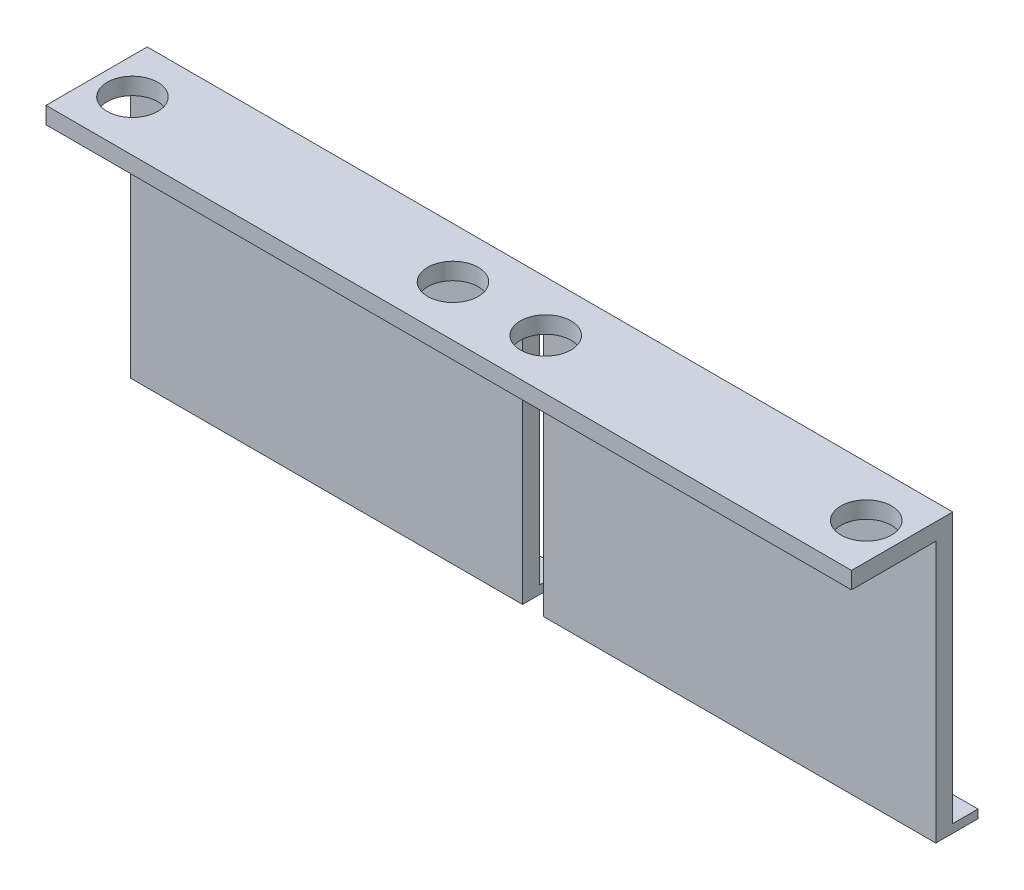
ISO-10303-21;
HEADER;
FILE_DESCRIPTION(('STEP AP214'),'2;1');
FILE_NAME('part.step','',(''),(''),'','','');
FILE_SCHEMA(('AUTOMOTIVE_DESIGN { 1 0 10303 214 1 1 1 1 }'));
ENDSEC;
DATA;
#1=APPLICATION_CONTEXT('core data for automotive mechanical design processes');
#2=APPLICATION_PROTOCOL_DEFINITION('international standard','automotive_design',2000,#1);
#3=PRODUCT_CONTEXT('',#1,'mechanical');
#4=PRODUCT('Part','Part','',(#3));
#5=PRODUCT_RELATED_PRODUCT_CATEGORY('part','',(#4));
#6=PRODUCT_DEFINITION_FORMATION('','',#4);
#7=PRODUCT_DEFINITION_CONTEXT('part definition',#1,'design');
#8=PRODUCT_DEFINITION('design','',#6,#7);
#9=PRODUCT_DEFINITION_SHAPE('','',#8);
#10=(LENGTH_UNIT() NAMED_UNIT(*) SI_UNIT(.MILLI.,.METRE.));
#11=(NAMED_UNIT(*) PLANE_ANGLE_UNIT() SI_UNIT($,.RADIAN.));
#12=(NAMED_UNIT(*) SI_UNIT($,.STERADIAN.) SOLID_ANGLE_UNIT());
#13=UNCERTAINTY_MEASURE_WITH_UNIT(LENGTH_MEASURE(1.E-05),#10,'distance_accuracy_value','');
#14=(GEOMETRIC_REPRESENTATION_CONTEXT(3) GLOBAL_UNCERTAINTY_ASSIGNED_CONTEXT((#13)) GLOBAL_UNIT_ASSIGNED_CONTEXT((#10,
#11,#12)) REPRESENTATION_CONTEXT('',''));
#15=CARTESIAN_POINT('',(0.,0.,0.));
#16=DIRECTION('',(0.,0.,1.));
#17=DIRECTION('',(1.,0.,0.));
#18=AXIS2_PLACEMENT_3D('',#15,#16,#17);
#19=CARTESIAN_POINT('',(0.,0.,0.));
#20=DIRECTION('',(0.,0.,-1.));
#21=DIRECTION('',(-1.,0.,0.));
#22=AXIS2_PLACEMENT_3D('',#19,#20,#21);
#23=PLANE('',#22);
#24=DIRECTION('',(0.,1.,0.));
#25=VECTOR('',#24,1.);
#26=CARTESIAN_POINT('',(-2.99862487690346,-11.2527197158987,0.));
#27=LINE('',#26,#25);
#28=CARTESIAN_POINT('',(-2.99862487690346,-10.2527197158987,0.));
#29=VERTEX_POINT('',#28);
#30=CARTESIAN_POINT('',(-2.99862487690346,17.7472802841013,0.));
#31=VERTEX_POINT('',#30);
#32=EDGE_CURVE('E260',#29,#31,#27,.T.);
#33=ORIENTED_EDGE('',*,*,#32,.F.);
#34=DIRECTION('',(1.,0.,0.));
#35=VECTOR('',#34,1.);
#36=CARTESIAN_POINT('',(-2.99862487690346,-10.2527197158987,0.));
#37=LINE('',#36,#35);
#38=CARTESIAN_POINT('',(-49.4986248769035,-10.2527197158987,0.));
#39=VERTEX_POINT('',#38);
#40=EDGE_CURVE('E162',#39,#29,#37,.T.);
#41=ORIENTED_EDGE('',*,*,#40,.F.);
#42=DIRECTION('',(0.,-1.,0.));
#43=VECTOR('',#42,1.);
#44=CARTESIAN_POINT('',(-49.4986248769035,-11.2527197158987,0.));
#45=LINE('',#44,#43);
#46=CARTESIAN_POINT('',(-49.4986248769035,21.7472802841013,0.));
#47=VERTEX_POINT('',#46);
#48=EDGE_CURVE('E257',#47,#39,#45,.T.);
#49=ORIENTED_EDGE('',*,*,#48,.F.);
#50=DIRECTION('',(-1.,0.,0.));
#51=VECTOR('',#50,1.);
#52=CARTESIAN_POINT('',(-49.4986248769035,21.7472802841013,0.));
#53=LINE('',#52,#51);
#54=CARTESIAN_POINT('',(46.0013751230965,21.7472802841013,0.));
#55=VERTEX_POINT('',#54);
#56=EDGE_CURVE('E215',#55,#47,#53,.T.);
#57=ORIENTED_EDGE('',*,*,#56,.F.);
#58=DIRECTION('',(0.,1.,0.));
#59=VECTOR('',#58,1.);
#60=CARTESIAN_POINT('',(46.0013751230965,-11.2527197158987,0.));
#61=LINE('',#60,#59);
#62=CARTESIAN_POINT('',(46.0013751230965,-10.2527197158987,0.));
#63=VERTEX_POINT('',#62);
#64=EDGE_CURVE('E213',#63,#55,#61,.T.);
#65=ORIENTED_EDGE('',*,*,#64,.F.);
#66=DIRECTION('',(1.,0.,0.));
#67=VECTOR('',#66,1.);
#68=CARTESIAN_POINT('',(46.0013751230965,-10.2527197158987,0.));
#69=LINE('',#68,#67);
#70=CARTESIAN_POINT('',(-0.498624876903456,-10.2527197158987,0.));
#71=VERTEX_POINT('',#70);
#72=EDGE_CURVE('E60',#71,#63,#69,.T.);
#73=ORIENTED_EDGE('',*,*,#72,.F.);
#74=DIRECTION('',(0.,-1.,0.));
#75=VECTOR('',#74,1.);
#76=CARTESIAN_POINT('',(-0.498624876903457,17.7472802841013,0.));
#77=LINE('',#76,#75);
#78=CARTESIAN_POINT('',(-0.498624876903457,17.7472802841013,0.));
#79=VERTEX_POINT('',#78);
#80=EDGE_CURVE('E189',#79,#71,#77,.T.);
#81=ORIENTED_EDGE('',*,*,#80,.F.);
#82=DIRECTION('',(1.,0.,0.));
#83=VECTOR('',#82,1.);
#84=CARTESIAN_POINT('',(-2.99862487690346,17.7472802841013,0.));
#85=LINE('',#84,#83);
#86=EDGE_CURVE('E262',#31,#79,#85,.T.);
#87=ORIENTED_EDGE('',*,*,#86,.F.);
#88=EDGE_LOOP('',(#33,#41,#49,#57,#65,#73,#81,#87));
#89=FACE_BOUND('',#88,.T.);
#90=ADVANCED_FACE('F35',(#89),#23,.T.);
#91=CARTESIAN_POINT('',(0.,0.,2.));
#92=DIRECTION('',(0.,0.,-1.));
#93=DIRECTION('',(-1.,0.,0.));
#94=AXIS2_PLACEMENT_3D('',#91,#92,#93);
#95=PLANE('',#94);
#96=DIRECTION('',(1.,0.,0.));
#97=VECTOR('',#96,1.);
#98=CARTESIAN_POINT('',(-49.4986248769035,19.7472802841013,2.));
#99=LINE('',#98,#97);
#100=CARTESIAN_POINT('',(-49.4986248769035,19.7472802841013,2.));
#101=VERTEX_POINT('',#100);
#102=CARTESIAN_POINT('',(46.0013751230965,19.7472802841013,2.));
#103=VERTEX_POINT('',#102);
#104=EDGE_CURVE('E480',#101,#103,#99,.T.);
#105=ORIENTED_EDGE('',*,*,#104,.F.);
#106=DIRECTION('',(0.,-1.,0.));
#107=VECTOR('',#106,1.);
#108=CARTESIAN_POINT('',(-49.4986248769035,-11.2527197158987,2.));
#109=LINE('',#108,#107);
#110=CARTESIAN_POINT('',(-49.4986248769035,-11.2527197158987,2.));
#111=VERTEX_POINT('',#110);
#112=EDGE_CURVE('E221',#101,#111,#109,.T.);
#113=ORIENTED_EDGE('',*,*,#112,.T.);
#114=DIRECTION('',(1.,0.,0.));
#115=VECTOR('',#114,1.);
#116=CARTESIAN_POINT('',(-49.4986248769035,-11.2527197158987,2.));
#117=LINE('',#116,#115);
#118=CARTESIAN_POINT('',(-2.99862487690346,-11.2527197158987,2.));
#119=VERTEX_POINT('',#118);
#120=EDGE_CURVE('E240',#111,#119,#117,.T.);
#121=ORIENTED_EDGE('',*,*,#120,.T.);
#122=DIRECTION('',(0.,1.,0.));
#123=VECTOR('',#122,1.);
#124=CARTESIAN_POINT('',(-2.99862487690346,-11.2527197158987,2.));
#125=LINE('',#124,#123);
#126=CARTESIAN_POINT('',(-2.99862487690346,17.7472802841013,2.));
#127=VERTEX_POINT('',#126);
#128=EDGE_CURVE('E146',#119,#127,#125,.T.);
#129=ORIENTED_EDGE('',*,*,#128,.T.);
#130=DIRECTION('',(1.,0.,0.));
#131=VECTOR('',#130,1.);
#132=CARTESIAN_POINT('',(-2.99862487690346,17.7472802841013,2.));
#133=LINE('',#132,#131);
#134=CARTESIAN_POINT('',(-0.498624876903457,17.7472802841013,2.));
#135=VERTEX_POINT('',#134);
#136=EDGE_CURVE('E250',#127,#135,#133,.T.);
#137=ORIENTED_EDGE('',*,*,#136,.T.);
#138=DIRECTION('',(0.,-1.,0.));
#139=VECTOR('',#138,1.);
#140=CARTESIAN_POINT('',(-0.498624876903457,17.7472802841013,2.));
#141=LINE('',#140,#139);
#142=CARTESIAN_POINT('',(-0.498624876903456,-11.2527197158987,2.));
#143=VERTEX_POINT('',#142);
#144=EDGE_CURVE('E252',#135,#143,#141,.T.);
#145=ORIENTED_EDGE('',*,*,#144,.T.);
#146=DIRECTION('',(1.,0.,0.));
#147=VECTOR('',#146,1.);
#148=CARTESIAN_POINT('',(-0.498624876903456,-11.2527197158987,2.));
#149=LINE('',#148,#147);
#150=CARTESIAN_POINT('',(46.0013751230965,-11.2527197158987,2.));
#151=VERTEX_POINT('',#150);
#152=EDGE_CURVE('E254',#143,#151,#149,.T.);
#153=ORIENTED_EDGE('',*,*,#152,.T.);
#154=DIRECTION('',(0.,1.,0.));
#155=VECTOR('',#154,1.);
#156=CARTESIAN_POINT('',(46.0013751230965,-11.2527197158987,2.));
#157=LINE('',#156,#155);
#158=EDGE_CURVE('E226',#151,#103,#157,.T.);
#159=ORIENTED_EDGE('',*,*,#158,.T.);
#160=EDGE_LOOP('',(#105,#113,#121,#129,#137,#145,#153,#159));
#161=FACE_BOUND('',#160,.T.);
#162=ADVANCED_FACE('F275',(#161),#95,.F.);
#163=CARTESIAN_POINT('',(-49.4986248769035,-11.2527197158987,2.));
#164=DIRECTION('',(1.,0.,0.));
#165=DIRECTION('',(0.,0.,-1.));
#166=AXIS2_PLACEMENT_3D('',#163,#164,#165);
#167=PLANE('',#166);
#168=ORIENTED_EDGE('',*,*,#48,.T.);
#169=DIRECTION('',(0.,0.,1.));
#170=VECTOR('',#169,1.);
#171=CARTESIAN_POINT('',(-49.4986248769035,-10.2527197158987,-3.));
#172=LINE('',#171,#170);
#173=CARTESIAN_POINT('',(-49.4986248769035,-10.2527197158987,-3.));
#174=VERTEX_POINT('',#173);
#175=EDGE_CURVE('E52',#174,#39,#172,.T.);
#176=ORIENTED_EDGE('',*,*,#175,.F.);
#177=DIRECTION('',(0.,1.,0.));
#178=VECTOR('',#177,1.);
#179=CARTESIAN_POINT('',(-49.4986248769035,-11.2527197158987,-3.));
#180=LINE('',#179,#178);
#181=CARTESIAN_POINT('',(-49.4986248769035,-11.2527197158987,-3.));
#182=VERTEX_POINT('',#181);
#183=EDGE_CURVE('E157',#182,#174,#180,.T.);
#184=ORIENTED_EDGE('',*,*,#183,.F.);
#185=DIRECTION('',(0.,0.,-1.));
#186=VECTOR('',#185,1.);
#187=CARTESIAN_POINT('',(-49.4986248769035,-11.2527197158987,2.));
#188=LINE('',#187,#186);
#189=EDGE_CURVE('E11',#111,#182,#188,.T.);
#190=ORIENTED_EDGE('',*,*,#189,.F.);
#191=ORIENTED_EDGE('',*,*,#112,.F.);
#192=DIRECTION('',(0.,0.,-1.));
#193=VECTOR('',#192,1.);
#194=CARTESIAN_POINT('',(-49.4986248769035,19.7472802841013,12.));
#195=LINE('',#194,#193);
#196=CARTESIAN_POINT('',(-49.4986248769035,19.7472802841013,12.));
#197=VERTEX_POINT('',#196);
#198=EDGE_CURVE('E261',#197,#101,#195,.T.);
#199=ORIENTED_EDGE('',*,*,#198,.F.);
#200=DIRECTION('',(0.,-1.,0.));
#201=VECTOR('',#200,1.);
#202=CARTESIAN_POINT('',(-49.4986248769035,21.7472802841013,12.));
#203=LINE('',#202,#201);
#204=CARTESIAN_POINT('',(-49.4986248769035,21.7472802841013,12.));
#205=VERTEX_POINT('',#204);
#206=EDGE_CURVE('E486',#205,#197,#203,.T.);
#207=ORIENTED_EDGE('',*,*,#206,.F.);
#208=DIRECTION('',(0.,0.,-1.));
#209=VECTOR('',#208,1.);
#210=CARTESIAN_POINT('',(-49.4986248769035,21.7472802841013,2.));
#211=LINE('',#210,#209);
#212=EDGE_CURVE('E222',#205,#47,#211,.T.);
#213=ORIENTED_EDGE('',*,*,#212,.T.);
#214=EDGE_LOOP('',(#168,#176,#184,#190,#191,#199,#207,#213));
#215=FACE_BOUND('',#214,.T.);
#216=ADVANCED_FACE('F37',(#215),#167,.F.);
#217=CARTESIAN_POINT('',(-49.4986248769035,-11.2527197158987,2.));
#218=DIRECTION('',(0.,1.,0.));
#219=DIRECTION('',(0.,0.,1.));
#220=AXIS2_PLACEMENT_3D('',#217,#218,#219);
#221=PLANE('',#220);
#222=ORIENTED_EDGE('',*,*,#189,.T.);
#223=DIRECTION('',(-1.,0.,0.));
#224=VECTOR('',#223,1.);
#225=CARTESIAN_POINT('',(-2.99862487690346,-11.2527197158987,-3.));
#226=LINE('',#225,#224);
#227=CARTESIAN_POINT('',(-2.99862487690346,-11.2527197158987,-3.));
#228=VERTEX_POINT('',#227);
#229=EDGE_CURVE('E152',#228,#182,#226,.T.);
#230=ORIENTED_EDGE('',*,*,#229,.F.);
#231=DIRECTION('',(0.,0.,-1.));
#232=VECTOR('',#231,1.);
#233=CARTESIAN_POINT('',(-2.99862487690346,-11.2527197158987,2.));
#234=LINE('',#233,#232);
#235=EDGE_CURVE('E44',#119,#228,#234,.T.);
#236=ORIENTED_EDGE('',*,*,#235,.F.);
#237=ORIENTED_EDGE('',*,*,#120,.F.);
#238=EDGE_LOOP('',(#222,#230,#236,#237));
#239=FACE_BOUND('',#238,.T.);
#240=ADVANCED_FACE('F153',(#239),#221,.F.);
#241=CARTESIAN_POINT('',(-2.99862487690346,-11.2527197158987,2.));
#242=DIRECTION('',(-1.,0.,0.));
#243=DIRECTION('',(0.,-1.,0.));
#244=AXIS2_PLACEMENT_3D('',#241,#242,#243);
#245=PLANE('',#244);
#246=ORIENTED_EDGE('',*,*,#235,.T.);
#247=DIRECTION('',(0.,-1.,0.));
#248=VECTOR('',#247,1.);
#249=CARTESIAN_POINT('',(-2.99862487690346,-11.2527197158987,-3.));
#250=LINE('',#249,#248);
#251=CARTESIAN_POINT('',(-2.99862487690346,-10.2527197158987,-3.));
#252=VERTEX_POINT('',#251);
#253=EDGE_CURVE('E144',#252,#228,#250,.T.);
#254=ORIENTED_EDGE('',*,*,#253,.F.);
#255=DIRECTION('',(0.,0.,1.));
#256=VECTOR('',#255,1.);
#257=CARTESIAN_POINT('',(-2.99862487690346,-10.2527197158987,-3.));
#258=LINE('',#257,#256);
#259=EDGE_CURVE('E167',#252,#29,#258,.T.);
#260=ORIENTED_EDGE('',*,*,#259,.T.);
#261=ORIENTED_EDGE('',*,*,#32,.T.);
#262=DIRECTION('',(0.,0.,-1.));
#263=VECTOR('',#262,1.);
#264=CARTESIAN_POINT('',(-2.99862487690346,17.7472802841013,2.));
#265=LINE('',#264,#263);
#266=EDGE_CURVE('E149',#127,#31,#265,.T.);
#267=ORIENTED_EDGE('',*,*,#266,.F.);
#268=ORIENTED_EDGE('',*,*,#128,.F.);
#269=EDGE_LOOP('',(#246,#254,#260,#261,#267,#268));
#270=FACE_BOUND('',#269,.T.);
#271=ADVANCED_FACE('F141',(#270),#245,.F.);
#272=CARTESIAN_POINT('',(-2.99862487690346,17.7472802841013,2.));
#273=DIRECTION('',(0.,1.,0.));
#274=DIRECTION('',(0.,0.,1.));
#275=AXIS2_PLACEMENT_3D('',#272,#273,#274);
#276=PLANE('',#275);
#277=ORIENTED_EDGE('',*,*,#86,.T.);
#278=DIRECTION('',(0.,0.,-1.));
#279=VECTOR('',#278,1.);
#280=CARTESIAN_POINT('',(-0.498624876903457,17.7472802841013,2.));
#281=LINE('',#280,#279);
#282=EDGE_CURVE('E233',#135,#79,#281,.T.);
#283=ORIENTED_EDGE('',*,*,#282,.F.);
#284=ORIENTED_EDGE('',*,*,#136,.F.);
#285=ORIENTED_EDGE('',*,*,#266,.T.);
#286=EDGE_LOOP('',(#277,#283,#284,#285));
#287=FACE_BOUND('',#286,.T.);
#288=ADVANCED_FACE('F273',(#287),#276,.F.);
#289=CARTESIAN_POINT('',(-0.498624876903457,17.7472802841013,2.));
#290=DIRECTION('',(1.,0.,0.));
#291=DIRECTION('',(0.,1.,0.));
#292=AXIS2_PLACEMENT_3D('',#289,#290,#291);
#293=PLANE('',#292);
#294=ORIENTED_EDGE('',*,*,#80,.T.);
#295=DIRECTION('',(0.,0.,1.));
#296=VECTOR('',#295,1.);
#297=CARTESIAN_POINT('',(-0.498624876903457,-10.2527197158987,-3.));
#298=LINE('',#297,#296);
#299=CARTESIAN_POINT('',(-0.498624876903457,-10.2527197158987,-3.));
#300=VERTEX_POINT('',#299);
#301=EDGE_CURVE('E194',#300,#71,#298,.T.);
#302=ORIENTED_EDGE('',*,*,#301,.F.);
#303=DIRECTION('',(0.,1.,0.));
#304=VECTOR('',#303,1.);
#305=CARTESIAN_POINT('',(-0.498624876903456,-11.2527197158987,-3.));
#306=LINE('',#305,#304);
#307=CARTESIAN_POINT('',(-0.498624876903456,-11.2527197158987,-3.));
#308=VERTEX_POINT('',#307);
#309=EDGE_CURVE('E177',#308,#300,#306,.T.);
#310=ORIENTED_EDGE('',*,*,#309,.F.);
#311=DIRECTION('',(0.,0.,-1.));
#312=VECTOR('',#311,1.);
#313=CARTESIAN_POINT('',(-0.498624876903456,-11.2527197158987,2.));
#314=LINE('',#313,#312);
#315=EDGE_CURVE('E231',#143,#308,#314,.T.);
#316=ORIENTED_EDGE('',*,*,#315,.F.);
#317=ORIENTED_EDGE('',*,*,#144,.F.);
#318=ORIENTED_EDGE('',*,*,#282,.T.);
#319=EDGE_LOOP('',(#294,#302,#310,#316,#317,#318));
#320=FACE_BOUND('',#319,.T.);
#321=ADVANCED_FACE('F267',(#320),#293,.F.);
#322=CARTESIAN_POINT('',(-0.498624876903456,-11.2527197158987,2.));
#323=DIRECTION('',(0.,1.,0.));
#324=DIRECTION('',(0.,0.,1.));
#325=AXIS2_PLACEMENT_3D('',#322,#323,#324);
#326=PLANE('',#325);
#327=ORIENTED_EDGE('',*,*,#315,.T.);
#328=DIRECTION('',(-1.,0.,0.));
#329=VECTOR('',#328,1.);
#330=CARTESIAN_POINT('',(46.0013751230965,-11.2527197158987,-3.));
#331=LINE('',#330,#329);
#332=CARTESIAN_POINT('',(46.0013751230965,-11.2527197158987,-3.));
#333=VERTEX_POINT('',#332);
#334=EDGE_CURVE('E174',#333,#308,#331,.T.);
#335=ORIENTED_EDGE('',*,*,#334,.F.);
#336=DIRECTION('',(0.,0.,-1.));
#337=VECTOR('',#336,1.);
#338=CARTESIAN_POINT('',(46.0013751230965,-11.2527197158987,2.));
#339=LINE('',#338,#337);
#340=EDGE_CURVE('E229',#151,#333,#339,.T.);
#341=ORIENTED_EDGE('',*,*,#340,.F.);
#342=ORIENTED_EDGE('',*,*,#152,.F.);
#343=EDGE_LOOP('',(#327,#335,#341,#342));
#344=FACE_BOUND('',#343,.T.);
#345=ADVANCED_FACE('F309',(#344),#326,.F.);
#346=CARTESIAN_POINT('',(46.0013751230965,-11.2527197158987,2.));
#347=DIRECTION('',(-1.,0.,0.));
#348=DIRECTION('',(0.,0.,1.));
#349=AXIS2_PLACEMENT_3D('',#346,#347,#348);
#350=PLANE('',#349);
#351=ORIENTED_EDGE('',*,*,#340,.T.);
#352=DIRECTION('',(0.,-1.,0.));
#353=VECTOR('',#352,1.);
#354=CARTESIAN_POINT('',(46.0013751230965,-11.2527197158987,-3.));
#355=LINE('',#354,#353);
#356=CARTESIAN_POINT('',(46.0013751230965,-10.2527197158987,-3.));
#357=VERTEX_POINT('',#356);
#358=EDGE_CURVE('E171',#357,#333,#355,.T.);
#359=ORIENTED_EDGE('',*,*,#358,.F.);
#360=DIRECTION('',(0.,0.,1.));
#361=VECTOR('',#360,1.);
#362=CARTESIAN_POINT('',(46.0013751230965,-10.2527197158987,-3.));
#363=LINE('',#362,#361);
#364=EDGE_CURVE('E181',#357,#63,#363,.T.);
#365=ORIENTED_EDGE('',*,*,#364,.T.);
#366=ORIENTED_EDGE('',*,*,#64,.T.);
#367=DIRECTION('',(0.,0.,-1.));
#368=VECTOR('',#367,1.);
#369=CARTESIAN_POINT('',(46.0013751230965,21.7472802841013,2.));
#370=LINE('',#369,#368);
#371=CARTESIAN_POINT('',(46.0013751230965,21.7472802841013,12.));
#372=VERTEX_POINT('',#371);
#373=EDGE_CURVE('E225',#372,#55,#370,.T.);
#374=ORIENTED_EDGE('',*,*,#373,.F.);
#375=DIRECTION('',(0.,1.,0.));
#376=VECTOR('',#375,1.);
#377=CARTESIAN_POINT('',(46.0013751230965,21.7472802841013,12.));
#378=LINE('',#377,#376);
#379=CARTESIAN_POINT('',(46.0013751230965,19.7472802841013,12.));
#380=VERTEX_POINT('',#379);
#381=EDGE_CURVE('E489',#380,#372,#378,.T.);
#382=ORIENTED_EDGE('',*,*,#381,.F.);
#383=DIRECTION('',(0.,0.,-1.));
#384=VECTOR('',#383,1.);
#385=CARTESIAN_POINT('',(46.0013751230965,19.7472802841013,12.));
#386=LINE('',#385,#384);
#387=EDGE_CURVE('E484',#380,#103,#386,.T.);
#388=ORIENTED_EDGE('',*,*,#387,.T.);
#389=ORIENTED_EDGE('',*,*,#158,.F.);
#390=EDGE_LOOP('',(#351,#359,#365,#366,#374,#382,#388,#389));
#391=FACE_BOUND('',#390,.T.);
#392=ADVANCED_FACE('F305',(#391),#350,.F.);
#393=CARTESIAN_POINT('',(-49.4986248769035,21.7472802841013,2.));
#394=DIRECTION('',(0.,-1.,0.));
#395=DIRECTION('',(0.,0.,-1.));
#396=AXIS2_PLACEMENT_3D('',#393,#394,#395);
#397=PLANE('',#396);
#398=CARTESIAN_POINT('',(41.7513751230965,21.7472802841013,6.));
#399=DIRECTION('',(0.,1.,0.));
#400=DIRECTION('',(0.,0.,1.));
#401=AXIS2_PLACEMENT_3D('',#398,#399,#400);
#402=CIRCLE('',#401,3.);
#403=CARTESIAN_POINT('',(41.7513751230965,21.7472802841013,9.));
#404=VERTEX_POINT('',#403);
#405=EDGE_CURVE('E184',#404,#404,#402,.T.);
#406=ORIENTED_EDGE('',*,*,#405,.F.);
#407=EDGE_LOOP('',(#406));
#408=FACE_BOUND('',#407,.T.);
#409=CARTESIAN_POINT('',(3.75137512309654,21.7472802841013,6.));
#410=DIRECTION('',(0.,1.,0.));
#411=DIRECTION('',(0.,0.,1.));
#412=AXIS2_PLACEMENT_3D('',#409,#410,#411);
#413=CIRCLE('',#412,3.);
#414=CARTESIAN_POINT('',(3.75137512309654,21.7472802841013,9.));
#415=VERTEX_POINT('',#414);
#416=EDGE_CURVE('E205',#415,#415,#413,.T.);
#417=ORIENTED_EDGE('',*,*,#416,.F.);
#418=EDGE_LOOP('',(#417));
#419=FACE_BOUND('',#418,.T.);
#420=CARTESIAN_POINT('',(-7.24862487690346,21.7472802841013,6.));
#421=DIRECTION('',(0.,1.,0.));
#422=DIRECTION('',(0.,0.,1.));
#423=AXIS2_PLACEMENT_3D('',#420,#421,#422);
#424=CIRCLE('',#423,3.);
#425=CARTESIAN_POINT('',(-7.24862487690346,21.7472802841013,9.));
#426=VERTEX_POINT('',#425);
#427=EDGE_CURVE('E503',#426,#426,#424,.T.);
#428=ORIENTED_EDGE('',*,*,#427,.F.);
#429=EDGE_LOOP('',(#428));
#430=FACE_BOUND('',#429,.T.);
#431=CARTESIAN_POINT('',(-45.2486248769035,21.7472802841013,6.));
#432=DIRECTION('',(0.,1.,0.));
#433=DIRECTION('',(0.,0.,1.));
#434=AXIS2_PLACEMENT_3D('',#431,#432,#433);
#435=CIRCLE('',#434,3.);
#436=CARTESIAN_POINT('',(-45.2486248769035,21.7472802841013,9.));
#437=VERTEX_POINT('',#436);
#438=EDGE_CURVE('E500',#437,#437,#435,.T.);
#439=ORIENTED_EDGE('',*,*,#438,.F.);
#440=EDGE_LOOP('',(#439));
#441=FACE_BOUND('',#440,.T.);
#442=ORIENTED_EDGE('',*,*,#56,.T.);
#443=ORIENTED_EDGE('',*,*,#212,.F.);
#444=DIRECTION('',(-1.,0.,0.));
#445=VECTOR('',#444,1.);
#446=CARTESIAN_POINT('',(-49.4986248769035,21.7472802841013,12.));
#447=LINE('',#446,#445);
#448=EDGE_CURVE('E490',#372,#205,#447,.T.);
#449=ORIENTED_EDGE('',*,*,#448,.F.);
#450=ORIENTED_EDGE('',*,*,#373,.T.);
#451=EDGE_LOOP('',(#442,#443,#449,#450));
#452=FACE_BOUND('',#451,.T.);
#453=ADVANCED_FACE('F301',(#408,#419,#430,#441,#452),#397,.F.);
#454=CARTESIAN_POINT('',(-49.4986248769035,19.7472802841013,12.));
#455=DIRECTION('',(0.,1.,0.));
#456=DIRECTION('',(0.,0.,1.));
#457=AXIS2_PLACEMENT_3D('',#454,#455,#456);
#458=PLANE('',#457);
#459=CARTESIAN_POINT('',(41.7513751230965,19.7472802841013,6.));
#460=DIRECTION('',(0.,1.,0.));
#461=DIRECTION('',(0.,0.,1.));
#462=AXIS2_PLACEMENT_3D('',#459,#460,#461);
#463=CIRCLE('',#462,3.);
#464=CARTESIAN_POINT('',(41.7513751230965,19.7472802841013,9.));
#465=VERTEX_POINT('',#464);
#466=EDGE_CURVE('E201',#465,#465,#463,.T.);
#467=ORIENTED_EDGE('',*,*,#466,.T.);
#468=EDGE_LOOP('',(#467));
#469=FACE_BOUND('',#468,.T.);
#470=CARTESIAN_POINT('',(3.75137512309654,19.7472802841013,6.));
#471=DIRECTION('',(0.,1.,0.));
#472=DIRECTION('',(0.,0.,1.));
#473=AXIS2_PLACEMENT_3D('',#470,#471,#472);
#474=CIRCLE('',#473,3.);
#475=CARTESIAN_POINT('',(3.75137512309654,19.7472802841013,9.));
#476=VERTEX_POINT('',#475);
#477=EDGE_CURVE('E210',#476,#476,#474,.T.);
#478=ORIENTED_EDGE('',*,*,#477,.T.);
#479=EDGE_LOOP('',(#478));
#480=FACE_BOUND('',#479,.T.);
#481=CARTESIAN_POINT('',(-7.24862487690346,19.7472802841013,6.));
#482=DIRECTION('',(0.,1.,0.));
#483=DIRECTION('',(0.,0.,1.));
#484=AXIS2_PLACEMENT_3D('',#481,#482,#483);
#485=CIRCLE('',#484,3.);
#486=CARTESIAN_POINT('',(-7.24862487690346,19.7472802841013,9.));
#487=VERTEX_POINT('',#486);
#488=EDGE_CURVE('E501',#487,#487,#485,.T.);
#489=ORIENTED_EDGE('',*,*,#488,.T.);
#490=EDGE_LOOP('',(#489));
#491=FACE_BOUND('',#490,.T.);
#492=CARTESIAN_POINT('',(-45.2486248769035,19.7472802841013,6.));
#493=DIRECTION('',(0.,1.,0.));
#494=DIRECTION('',(0.,0.,1.));
#495=AXIS2_PLACEMENT_3D('',#492,#493,#494);
#496=CIRCLE('',#495,3.);
#497=CARTESIAN_POINT('',(-45.2486248769035,19.7472802841013,9.));
#498=VERTEX_POINT('',#497);
#499=EDGE_CURVE('E487',#498,#498,#496,.T.);
#500=ORIENTED_EDGE('',*,*,#499,.T.);
#501=EDGE_LOOP('',(#500));
#502=FACE_BOUND('',#501,.T.);
#503=ORIENTED_EDGE('',*,*,#104,.T.);
#504=ORIENTED_EDGE('',*,*,#387,.F.);
#505=DIRECTION('',(1.,0.,0.));
#506=VECTOR('',#505,1.);
#507=CARTESIAN_POINT('',(-49.4986248769035,19.7472802841013,12.));
#508=LINE('',#507,#506);
#509=EDGE_CURVE('E515',#197,#380,#508,.T.);
#510=ORIENTED_EDGE('',*,*,#509,.F.);
#511=ORIENTED_EDGE('',*,*,#198,.T.);
#512=EDGE_LOOP('',(#503,#504,#510,#511));
#513=FACE_BOUND('',#512,.T.);
#514=ADVANCED_FACE('F304',(#469,#480,#491,#502,#513),#458,.F.);
#515=CARTESIAN_POINT('',(0.,0.,12.));
#516=DIRECTION('',(0.,0.,1.));
#517=DIRECTION('',(1.,0.,0.));
#518=AXIS2_PLACEMENT_3D('',#515,#516,#517);
#519=PLANE('',#518);
#520=ORIENTED_EDGE('',*,*,#206,.T.);
#521=ORIENTED_EDGE('',*,*,#509,.T.);
#522=ORIENTED_EDGE('',*,*,#381,.T.);
#523=ORIENTED_EDGE('',*,*,#448,.T.);
#524=EDGE_LOOP('',(#520,#521,#522,#523));
#525=FACE_BOUND('',#524,.T.);
#526=ADVANCED_FACE('F339',(#525),#519,.T.);
#527=CARTESIAN_POINT('',(-45.2486248769035,-11.2527447158987,6.));
#528=DIRECTION('',(0.,1.,0.));
#529=DIRECTION('',(0.,0.,1.));
#530=AXIS2_PLACEMENT_3D('',#527,#528,#529);
#531=CYLINDRICAL_SURFACE('',#530,3.);
#532=ORIENTED_EDGE('',*,*,#438,.T.);
#533=EDGE_LOOP('',(#532));
#534=FACE_BOUND('',#533,.T.);
#535=ORIENTED_EDGE('',*,*,#499,.F.);
#536=EDGE_LOOP('',(#535));
#537=FACE_BOUND('',#536,.T.);
#538=ADVANCED_FACE('F344',(#534,#537),#531,.F.);
#539=CARTESIAN_POINT('',(-7.24862487690346,-11.2527447158987,6.));
#540=DIRECTION('',(0.,1.,0.));
#541=DIRECTION('',(0.,0.,1.));
#542=AXIS2_PLACEMENT_3D('',#539,#540,#541);
#543=CYLINDRICAL_SURFACE('',#542,3.);
#544=ORIENTED_EDGE('',*,*,#427,.T.);
#545=EDGE_LOOP('',(#544));
#546=FACE_BOUND('',#545,.T.);
#547=ORIENTED_EDGE('',*,*,#488,.F.);
#548=EDGE_LOOP('',(#547));
#549=FACE_BOUND('',#548,.T.);
#550=ADVANCED_FACE('F368',(#546,#549),#543,.F.);
#551=CARTESIAN_POINT('',(3.75137512309654,-11.2527447158987,6.));
#552=DIRECTION('',(0.,1.,0.));
#553=DIRECTION('',(0.,0.,1.));
#554=AXIS2_PLACEMENT_3D('',#551,#552,#553);
#555=CYLINDRICAL_SURFACE('',#554,3.);
#556=ORIENTED_EDGE('',*,*,#416,.T.);
#557=EDGE_LOOP('',(#556));
#558=FACE_BOUND('',#557,.T.);
#559=ORIENTED_EDGE('',*,*,#477,.F.);
#560=EDGE_LOOP('',(#559));
#561=FACE_BOUND('',#560,.T.);
#562=ADVANCED_FACE('F378',(#558,#561),#555,.F.);
#563=CARTESIAN_POINT('',(41.7513751230965,-11.2527447158987,6.));
#564=DIRECTION('',(0.,1.,0.));
#565=DIRECTION('',(0.,0.,1.));
#566=AXIS2_PLACEMENT_3D('',#563,#564,#565);
#567=CYLINDRICAL_SURFACE('',#566,3.);
#568=ORIENTED_EDGE('',*,*,#405,.T.);
#569=EDGE_LOOP('',(#568));
#570=FACE_BOUND('',#569,.T.);
#571=ORIENTED_EDGE('',*,*,#466,.F.);
#572=EDGE_LOOP('',(#571));
#573=FACE_BOUND('',#572,.T.);
#574=ADVANCED_FACE('F388',(#570,#573),#567,.F.);
#575=CARTESIAN_POINT('',(46.0013751230965,-10.2527197158987,-3.));
#576=DIRECTION('',(0.,-1.,0.));
#577=DIRECTION('',(0.,0.,-1.));
#578=AXIS2_PLACEMENT_3D('',#575,#576,#577);
#579=PLANE('',#578);
#580=ORIENTED_EDGE('',*,*,#72,.T.);
#581=ORIENTED_EDGE('',*,*,#364,.F.);
#582=DIRECTION('',(1.,0.,0.));
#583=VECTOR('',#582,1.);
#584=CARTESIAN_POINT('',(46.0013751230965,-10.2527197158987,-3.));
#585=LINE('',#584,#583);
#586=EDGE_CURVE('E179',#300,#357,#585,.T.);
#587=ORIENTED_EDGE('',*,*,#586,.F.);
#588=ORIENTED_EDGE('',*,*,#301,.T.);
#589=EDGE_LOOP('',(#580,#581,#587,#588));
#590=FACE_BOUND('',#589,.T.);
#591=ADVANCED_FACE('F290',(#590),#579,.F.);
#592=CARTESIAN_POINT('',(0.,0.,-3.));
#593=DIRECTION('',(0.,0.,1.));
#594=DIRECTION('',(1.,0.,0.));
#595=AXIS2_PLACEMENT_3D('',#592,#593,#594);
#596=PLANE('',#595);
#597=ORIENTED_EDGE('',*,*,#358,.T.);
#598=ORIENTED_EDGE('',*,*,#334,.T.);
#599=ORIENTED_EDGE('',*,*,#309,.T.);
#600=ORIENTED_EDGE('',*,*,#586,.T.);
#601=EDGE_LOOP('',(#597,#598,#599,#600));
#602=FACE_BOUND('',#601,.T.);
#603=ADVANCED_FACE('F283',(#602),#596,.F.);
#604=CARTESIAN_POINT('',(-2.99862487690346,-10.2527197158987,-3.));
#605=DIRECTION('',(0.,-1.,0.));
#606=DIRECTION('',(0.,0.,-1.));
#607=AXIS2_PLACEMENT_3D('',#604,#605,#606);
#608=PLANE('',#607);
#609=ORIENTED_EDGE('',*,*,#40,.T.);
#610=ORIENTED_EDGE('',*,*,#259,.F.);
#611=DIRECTION('',(1.,0.,0.));
#612=VECTOR('',#611,1.);
#613=CARTESIAN_POINT('',(-2.99862487690346,-10.2527197158987,-3.));
#614=LINE('',#613,#612);
#615=EDGE_CURVE('E160',#174,#252,#614,.T.);
#616=ORIENTED_EDGE('',*,*,#615,.F.);
#617=ORIENTED_EDGE('',*,*,#175,.T.);
#618=EDGE_LOOP('',(#609,#610,#616,#617));
#619=FACE_BOUND('',#618,.T.);
#620=ADVANCED_FACE('F281',(#619),#608,.F.);
#621=CARTESIAN_POINT('',(0.,0.,-3.));
#622=DIRECTION('',(0.,0.,1.));
#623=DIRECTION('',(1.,0.,0.));
#624=AXIS2_PLACEMENT_3D('',#621,#622,#623);
#625=PLANE('',#624);
#626=ORIENTED_EDGE('',*,*,#253,.T.);
#627=ORIENTED_EDGE('',*,*,#229,.T.);
#628=ORIENTED_EDGE('',*,*,#183,.T.);
#629=ORIENTED_EDGE('',*,*,#615,.T.);
#630=EDGE_LOOP('',(#626,#627,#628,#629));
#631=FACE_BOUND('',#630,.T.);
#632=ADVANCED_FACE('F159',(#631),#625,.F.);
#633=CLOSED_SHELL('',(#90,#162,#216,#240,#271,#288,#321,#345,#392,#453,#514,#526,#538,#550,#562,
#574,#591,#603,#620,#632));
#634=MANIFOLD_SOLID_BREP('B2',#633);
#635=ADVANCED_BREP_SHAPE_REPRESENTATION('',(#18,#634),#14);
#636=SHAPE_DEFINITION_REPRESENTATION(#9,#635);
ENDSEC;
END-ISO-10303-21;
